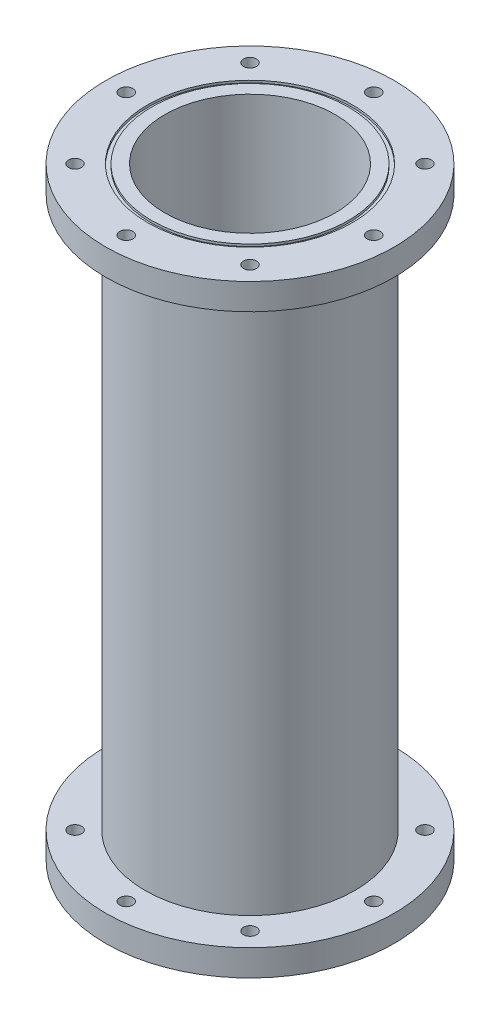
ISO-10303-21;
HEADER;
FILE_DESCRIPTION(('STEP AP214'),'2;1');
FILE_NAME('part.step','',(''),(''),'','','');
FILE_SCHEMA(('AUTOMOTIVE_DESIGN { 1 0 10303 214 1 1 1 1 }'));
ENDSEC;
DATA;
#1=APPLICATION_CONTEXT('core data for automotive mechanical design processes');
#2=APPLICATION_PROTOCOL_DEFINITION('international standard','automotive_design',2000,#1);
#3=PRODUCT_CONTEXT('',#1,'mechanical');
#4=PRODUCT('Part','Part','',(#3));
#5=PRODUCT_RELATED_PRODUCT_CATEGORY('part','',(#4));
#6=PRODUCT_DEFINITION_FORMATION('','',#4);
#7=PRODUCT_DEFINITION_CONTEXT('part definition',#1,'design');
#8=PRODUCT_DEFINITION('design','',#6,#7);
#9=PRODUCT_DEFINITION_SHAPE('','',#8);
#10=(LENGTH_UNIT() NAMED_UNIT(*) SI_UNIT(.MILLI.,.METRE.));
#11=(NAMED_UNIT(*) PLANE_ANGLE_UNIT() SI_UNIT($,.RADIAN.));
#12=(NAMED_UNIT(*) SI_UNIT($,.STERADIAN.) SOLID_ANGLE_UNIT());
#13=UNCERTAINTY_MEASURE_WITH_UNIT(LENGTH_MEASURE(1.E-05),#10,'distance_accuracy_value','');
#14=(GEOMETRIC_REPRESENTATION_CONTEXT(3) GLOBAL_UNCERTAINTY_ASSIGNED_CONTEXT((#13)) GLOBAL_UNIT_ASSIGNED_CONTEXT((#10,
#11,#12)) REPRESENTATION_CONTEXT('',''));
#15=CARTESIAN_POINT('',(0.,0.,0.));
#16=DIRECTION('',(0.,0.,1.));
#17=DIRECTION('',(1.,0.,0.));
#18=AXIS2_PLACEMENT_3D('',#15,#16,#17);
#19=CARTESIAN_POINT('',(0.,292.1,0.));
#20=DIRECTION('',(0.,1.,0.));
#21=DIRECTION('',(0.,0.,1.));
#22=AXIS2_PLACEMENT_3D('',#19,#20,#21);
#23=PLANE('',#22);
#24=CARTESIAN_POINT('',(0.,292.1,0.));
#25=DIRECTION('',(0.,1.,0.));
#26=DIRECTION('',(0.,0.,1.));
#27=AXIS2_PLACEMENT_3D('',#24,#25,#26);
#28=CIRCLE('',#27,41.275);
#29=CARTESIAN_POINT('',(0.,292.1,41.275));
#30=VERTEX_POINT('',#29);
#31=EDGE_CURVE('E45',#30,#30,#28,.T.);
#32=ORIENTED_EDGE('',*,*,#31,.F.);
#33=EDGE_LOOP('',(#32));
#34=FACE_BOUND('',#33,.T.);
#35=CARTESIAN_POINT('',(0.,292.1,0.));
#36=DIRECTION('',(0.,1.,0.));
#37=DIRECTION('',(0.,0.,1.));
#38=AXIS2_PLACEMENT_3D('',#35,#36,#37);
#39=CIRCLE('',#38,47.625);
#40=CARTESIAN_POINT('',(0.,292.1,47.625));
#41=VERTEX_POINT('',#40);
#42=EDGE_CURVE('E117',#41,#41,#39,.T.);
#43=ORIENTED_EDGE('',*,*,#42,.T.);
#44=EDGE_LOOP('',(#43));
#45=FACE_BOUND('',#44,.T.);
#46=ADVANCED_FACE('F32',(#34,#45),#23,.T.);
#47=CARTESIAN_POINT('',(0.,0.,0.));
#48=DIRECTION('',(0.,1.,0.));
#49=DIRECTION('',(0.,0.,1.));
#50=AXIS2_PLACEMENT_3D('',#47,#48,#49);
#51=PLANE('',#50);
#52=CARTESIAN_POINT('',(0.,0.,0.));
#53=DIRECTION('',(0.,1.,0.));
#54=DIRECTION('',(0.,0.,1.));
#55=AXIS2_PLACEMENT_3D('',#52,#53,#54);
#56=CIRCLE('',#55,41.275);
#57=CARTESIAN_POINT('',(0.,0.,41.275));
#58=VERTEX_POINT('',#57);
#59=EDGE_CURVE('E54',#58,#58,#56,.T.);
#60=ORIENTED_EDGE('',*,*,#59,.T.);
#61=EDGE_LOOP('',(#60));
#62=FACE_BOUND('',#61,.T.);
#63=CARTESIAN_POINT('',(0.,0.,0.));
#64=DIRECTION('',(0.,-1.,0.));
#65=DIRECTION('',(0.,0.,-1.));
#66=AXIS2_PLACEMENT_3D('',#63,#64,#65);
#67=CIRCLE('',#66,47.625);
#68=CARTESIAN_POINT('',(0.,0.,-47.625));
#69=VERTEX_POINT('',#68);
#70=EDGE_CURVE('E127',#69,#69,#67,.T.);
#71=ORIENTED_EDGE('',*,*,#70,.T.);
#72=EDGE_LOOP('',(#71));
#73=FACE_BOUND('',#72,.T.);
#74=ADVANCED_FACE('F165',(#62,#73),#51,.F.);
#75=CARTESIAN_POINT('',(0.,292.1,0.));
#76=DIRECTION('',(0.,-1.,0.));
#77=DIRECTION('',(0.,0.,-1.));
#78=AXIS2_PLACEMENT_3D('',#75,#76,#77);
#79=CYLINDRICAL_SURFACE('',#78,50.8);
#80=CARTESIAN_POINT('',(0.,12.7,0.));
#81=DIRECTION('',(0.,-1.,0.));
#82=DIRECTION('',(0.,0.,-1.));
#83=AXIS2_PLACEMENT_3D('',#80,#81,#82);
#84=CIRCLE('',#83,50.8);
#85=CARTESIAN_POINT('',(0.,12.7,-50.8));
#86=VERTEX_POINT('',#85);
#87=EDGE_CURVE('E40',#86,#86,#84,.T.);
#88=ORIENTED_EDGE('',*,*,#87,.F.);
#89=EDGE_LOOP('',(#88));
#90=FACE_BOUND('',#89,.T.);
#91=CARTESIAN_POINT('',(0.,279.4,0.));
#92=DIRECTION('',(0.,1.,0.));
#93=DIRECTION('',(0.,0.,1.));
#94=AXIS2_PLACEMENT_3D('',#91,#92,#93);
#95=CIRCLE('',#94,50.8);
#96=CARTESIAN_POINT('',(0.,279.4,50.8));
#97=VERTEX_POINT('',#96);
#98=EDGE_CURVE('E10',#97,#97,#95,.T.);
#99=ORIENTED_EDGE('',*,*,#98,.F.);
#100=EDGE_LOOP('',(#99));
#101=FACE_BOUND('',#100,.T.);
#102=ADVANCED_FACE('F34',(#90,#101),#79,.T.);
#103=CARTESIAN_POINT('',(-59.9186,292.1,0.));
#104=DIRECTION('',(0.,-1.,0.));
#105=DIRECTION('',(0.,0.,-1.));
#106=AXIS2_PLACEMENT_3D('',#103,#104,#105);
#107=CIRCLE('',#106,3.175);
#108=CARTESIAN_POINT('',(-59.9186,292.1,-3.175));
#109=VERTEX_POINT('',#108);
#110=EDGE_CURVE('E67',#109,#109,#107,.T.);
#111=ORIENTED_EDGE('',*,*,#110,.T.);
#112=EDGE_LOOP('',(#111));
#113=FACE_BOUND('',#112,.T.);
#114=CARTESIAN_POINT('',(-42.3688483792043,292.1,42.3688483792043));
#115=DIRECTION('',(0.,-1.,0.));
#116=DIRECTION('',(0.,0.,-1.));
#117=AXIS2_PLACEMENT_3D('',#114,#115,#116);
#118=CIRCLE('',#117,3.175);
#119=CARTESIAN_POINT('',(-42.3688483792043,292.1,39.1938483792043));
#120=VERTEX_POINT('',#119);
#121=EDGE_CURVE('E191',#120,#120,#118,.T.);
#122=ORIENTED_EDGE('',*,*,#121,.T.);
#123=EDGE_LOOP('',(#122));
#124=FACE_BOUND('',#123,.T.);
#125=CARTESIAN_POINT('',(0.,292.1,59.9186));
#126=DIRECTION('',(0.,-1.,0.));
#127=DIRECTION('',(0.,0.,-1.));
#128=AXIS2_PLACEMENT_3D('',#125,#126,#127);
#129=CIRCLE('',#128,3.175);
#130=CARTESIAN_POINT('',(0.,292.1,56.7436));
#131=VERTEX_POINT('',#130);
#132=EDGE_CURVE('E195',#131,#131,#129,.T.);
#133=ORIENTED_EDGE('',*,*,#132,.T.);
#134=EDGE_LOOP('',(#133));
#135=FACE_BOUND('',#134,.T.);
#136=CARTESIAN_POINT('',(42.3688483792043,292.1,42.3688483792043));
#137=DIRECTION('',(0.,-1.,0.));
#138=DIRECTION('',(0.,0.,-1.));
#139=AXIS2_PLACEMENT_3D('',#136,#137,#138);
#140=CIRCLE('',#139,3.175);
#141=CARTESIAN_POINT('',(42.3688483792043,292.1,39.1938483792043));
#142=VERTEX_POINT('',#141);
#143=EDGE_CURVE('E199',#142,#142,#140,.T.);
#144=ORIENTED_EDGE('',*,*,#143,.T.);
#145=EDGE_LOOP('',(#144));
#146=FACE_BOUND('',#145,.T.);
#147=CARTESIAN_POINT('',(59.9186,292.1,0.));
#148=DIRECTION('',(0.,-1.,0.));
#149=DIRECTION('',(0.,0.,-1.));
#150=AXIS2_PLACEMENT_3D('',#147,#148,#149);
#151=CIRCLE('',#150,3.17500000000001);
#152=CARTESIAN_POINT('',(59.9186,292.1,-3.175));
#153=VERTEX_POINT('',#152);
#154=EDGE_CURVE('E203',#153,#153,#151,.T.);
#155=ORIENTED_EDGE('',*,*,#154,.T.);
#156=EDGE_LOOP('',(#155));
#157=FACE_BOUND('',#156,.T.);
#158=CARTESIAN_POINT('',(42.3688483792043,292.1,-42.3688483792043));
#159=DIRECTION('',(0.,-1.,0.));
#160=DIRECTION('',(0.,0.,-1.));
#161=AXIS2_PLACEMENT_3D('',#158,#159,#160);
#162=CIRCLE('',#161,3.17500000000001);
#163=CARTESIAN_POINT('',(42.3688483792043,292.1,-45.5438483792043));
#164=VERTEX_POINT('',#163);
#165=EDGE_CURVE('E207',#164,#164,#162,.T.);
#166=ORIENTED_EDGE('',*,*,#165,.T.);
#167=EDGE_LOOP('',(#166));
#168=FACE_BOUND('',#167,.T.);
#169=CARTESIAN_POINT('',(0.,292.1,-59.9186));
#170=DIRECTION('',(0.,-1.,0.));
#171=DIRECTION('',(0.,0.,-1.));
#172=AXIS2_PLACEMENT_3D('',#169,#170,#171);
#173=CIRCLE('',#172,3.175);
#174=CARTESIAN_POINT('',(0.,292.1,-63.0936));
#175=VERTEX_POINT('',#174);
#176=EDGE_CURVE('E211',#175,#175,#173,.T.);
#177=ORIENTED_EDGE('',*,*,#176,.T.);
#178=EDGE_LOOP('',(#177));
#179=FACE_BOUND('',#178,.T.);
#180=CARTESIAN_POINT('',(-42.3688483792043,292.1,-42.3688483792043));
#181=DIRECTION('',(0.,-1.,0.));
#182=DIRECTION('',(0.,0.,-1.));
#183=AXIS2_PLACEMENT_3D('',#180,#181,#182);
#184=CIRCLE('',#183,3.17500000000001);
#185=CARTESIAN_POINT('',(-42.3688483792043,292.1,-45.5438483792043));
#186=VERTEX_POINT('',#185);
#187=EDGE_CURVE('E215',#186,#186,#184,.T.);
#188=ORIENTED_EDGE('',*,*,#187,.T.);
#189=EDGE_LOOP('',(#188));
#190=FACE_BOUND('',#189,.T.);
#191=CARTESIAN_POINT('',(0.,292.1,0.));
#192=DIRECTION('',(0.,1.,0.));
#193=DIRECTION('',(0.,0.,1.));
#194=AXIS2_PLACEMENT_3D('',#191,#192,#193);
#195=CIRCLE('',#194,49.53);
#196=CARTESIAN_POINT('',(0.,292.1,49.53));
#197=VERTEX_POINT('',#196);
#198=EDGE_CURVE('E121',#197,#197,#195,.T.);
#199=ORIENTED_EDGE('',*,*,#198,.F.);
#200=EDGE_LOOP('',(#199));
#201=FACE_BOUND('',#200,.T.);
#202=CARTESIAN_POINT('',(0.,292.1,0.));
#203=DIRECTION('',(0.,1.,0.));
#204=DIRECTION('',(0.,0.,1.));
#205=AXIS2_PLACEMENT_3D('',#202,#203,#204);
#206=CIRCLE('',#205,69.85);
#207=CARTESIAN_POINT('',(0.,292.1,69.85));
#208=VERTEX_POINT('',#207);
#209=EDGE_CURVE('E49',#208,#208,#206,.T.);
#210=ORIENTED_EDGE('',*,*,#209,.T.);
#211=EDGE_LOOP('',(#210));
#212=FACE_BOUND('',#211,.T.);
#213=ADVANCED_FACE('F146',(#113,#124,#135,#146,#157,#168,#179,#190,#201,#212),#23,.T.);
#214=CARTESIAN_POINT('',(-59.9186,0.,0.));
#215=DIRECTION('',(0.,1.,0.));
#216=DIRECTION('',(0.,0.,1.));
#217=AXIS2_PLACEMENT_3D('',#214,#215,#216);
#218=CIRCLE('',#217,3.175);
#219=CARTESIAN_POINT('',(-59.9186,0.,3.175));
#220=VERTEX_POINT('',#219);
#221=EDGE_CURVE('E114',#220,#220,#218,.T.);
#222=ORIENTED_EDGE('',*,*,#221,.T.);
#223=EDGE_LOOP('',(#222));
#224=FACE_BOUND('',#223,.T.);
#225=CARTESIAN_POINT('',(-42.3688483792043,0.,42.3688483792043));
#226=DIRECTION('',(0.,1.,0.));
#227=DIRECTION('',(0.,0.,1.));
#228=AXIS2_PLACEMENT_3D('',#225,#226,#227);
#229=CIRCLE('',#228,3.175);
#230=CARTESIAN_POINT('',(-42.3688483792043,0.,45.5438483792043));
#231=VERTEX_POINT('',#230);
#232=EDGE_CURVE('E99',#231,#231,#229,.T.);
#233=ORIENTED_EDGE('',*,*,#232,.T.);
#234=EDGE_LOOP('',(#233));
#235=FACE_BOUND('',#234,.T.);
#236=CARTESIAN_POINT('',(0.,0.,59.9186));
#237=DIRECTION('',(0.,1.,0.));
#238=DIRECTION('',(0.,0.,1.));
#239=AXIS2_PLACEMENT_3D('',#236,#237,#238);
#240=CIRCLE('',#239,3.175);
#241=CARTESIAN_POINT('',(0.,0.,63.0936));
#242=VERTEX_POINT('',#241);
#243=EDGE_CURVE('E95',#242,#242,#240,.T.);
#244=ORIENTED_EDGE('',*,*,#243,.T.);
#245=EDGE_LOOP('',(#244));
#246=FACE_BOUND('',#245,.T.);
#247=CARTESIAN_POINT('',(42.3688483792043,0.,42.3688483792043));
#248=DIRECTION('',(0.,1.,0.));
#249=DIRECTION('',(0.,0.,1.));
#250=AXIS2_PLACEMENT_3D('',#247,#248,#249);
#251=CIRCLE('',#250,3.175);
#252=CARTESIAN_POINT('',(42.3688483792043,0.,45.5438483792043));
#253=VERTEX_POINT('',#252);
#254=EDGE_CURVE('E91',#253,#253,#251,.T.);
#255=ORIENTED_EDGE('',*,*,#254,.T.);
#256=EDGE_LOOP('',(#255));
#257=FACE_BOUND('',#256,.T.);
#258=CARTESIAN_POINT('',(59.9186,0.,0.));
#259=DIRECTION('',(0.,1.,0.));
#260=DIRECTION('',(0.,0.,1.));
#261=AXIS2_PLACEMENT_3D('',#258,#259,#260);
#262=CIRCLE('',#261,3.17500000000001);
#263=CARTESIAN_POINT('',(59.9186,0.,3.17500000000001));
#264=VERTEX_POINT('',#263);
#265=EDGE_CURVE('E87',#264,#264,#262,.T.);
#266=ORIENTED_EDGE('',*,*,#265,.T.);
#267=EDGE_LOOP('',(#266));
#268=FACE_BOUND('',#267,.T.);
#269=CARTESIAN_POINT('',(42.3688483792043,0.,-42.3688483792043));
#270=DIRECTION('',(0.,1.,0.));
#271=DIRECTION('',(0.,0.,1.));
#272=AXIS2_PLACEMENT_3D('',#269,#270,#271);
#273=CIRCLE('',#272,3.17500000000001);
#274=CARTESIAN_POINT('',(42.3688483792043,0.,-39.1938483792043));
#275=VERTEX_POINT('',#274);
#276=EDGE_CURVE('E82',#275,#275,#273,.T.);
#277=ORIENTED_EDGE('',*,*,#276,.T.);
#278=EDGE_LOOP('',(#277));
#279=FACE_BOUND('',#278,.T.);
#280=CARTESIAN_POINT('',(0.,0.,-59.9186));
#281=DIRECTION('',(0.,1.,0.));
#282=DIRECTION('',(0.,0.,1.));
#283=AXIS2_PLACEMENT_3D('',#280,#281,#282);
#284=CIRCLE('',#283,3.175);
#285=CARTESIAN_POINT('',(0.,0.,-56.7436));
#286=VERTEX_POINT('',#285);
#287=EDGE_CURVE('E77',#286,#286,#284,.T.);
#288=ORIENTED_EDGE('',*,*,#287,.T.);
#289=EDGE_LOOP('',(#288));
#290=FACE_BOUND('',#289,.T.);
#291=CARTESIAN_POINT('',(-42.3688483792043,0.,-42.3688483792043));
#292=DIRECTION('',(0.,1.,0.));
#293=DIRECTION('',(0.,0.,1.));
#294=AXIS2_PLACEMENT_3D('',#291,#292,#293);
#295=CIRCLE('',#294,3.17500000000001);
#296=CARTESIAN_POINT('',(-42.3688483792043,0.,-39.1938483792043));
#297=VERTEX_POINT('',#296);
#298=EDGE_CURVE('E72',#297,#297,#295,.T.);
#299=ORIENTED_EDGE('',*,*,#298,.T.);
#300=EDGE_LOOP('',(#299));
#301=FACE_BOUND('',#300,.T.);
#302=CARTESIAN_POINT('',(0.,0.,0.));
#303=DIRECTION('',(0.,-1.,0.));
#304=DIRECTION('',(0.,0.,-1.));
#305=AXIS2_PLACEMENT_3D('',#302,#303,#304);
#306=CIRCLE('',#305,49.53);
#307=CARTESIAN_POINT('',(0.,0.,-49.53));
#308=VERTEX_POINT('',#307);
#309=EDGE_CURVE('E133',#308,#308,#306,.T.);
#310=ORIENTED_EDGE('',*,*,#309,.F.);
#311=EDGE_LOOP('',(#310));
#312=FACE_BOUND('',#311,.T.);
#313=CARTESIAN_POINT('',(0.,0.,0.));
#314=DIRECTION('',(0.,-1.,0.));
#315=DIRECTION('',(0.,0.,-1.));
#316=AXIS2_PLACEMENT_3D('',#313,#314,#315);
#317=CIRCLE('',#316,69.85);
#318=CARTESIAN_POINT('',(0.,0.,-69.85));
#319=VERTEX_POINT('',#318);
#320=EDGE_CURVE('E55',#319,#319,#317,.T.);
#321=ORIENTED_EDGE('',*,*,#320,.T.);
#322=EDGE_LOOP('',(#321));
#323=FACE_BOUND('',#322,.T.);
#324=ADVANCED_FACE('F172',(#224,#235,#246,#257,#268,#279,#290,#301,#312,#323),#51,.F.);
#325=CARTESIAN_POINT('',(0.,292.1,0.));
#326=DIRECTION('',(0.,-1.,0.));
#327=DIRECTION('',(0.,0.,-1.));
#328=AXIS2_PLACEMENT_3D('',#325,#326,#327);
#329=CYLINDRICAL_SURFACE('',#328,41.275);
#330=ORIENTED_EDGE('',*,*,#31,.T.);
#331=EDGE_LOOP('',(#330));
#332=FACE_BOUND('',#331,.T.);
#333=ORIENTED_EDGE('',*,*,#59,.F.);
#334=EDGE_LOOP('',(#333));
#335=FACE_BOUND('',#334,.T.);
#336=ADVANCED_FACE('F182',(#332,#335),#329,.F.);
#337=CARTESIAN_POINT('',(0.,12.7,0.));
#338=DIRECTION('',(0.,-1.,0.));
#339=DIRECTION('',(0.,0.,-1.));
#340=AXIS2_PLACEMENT_3D('',#337,#338,#339);
#341=PLANE('',#340);
#342=CARTESIAN_POINT('',(-59.9186,12.7,0.));
#343=DIRECTION('',(0.,-1.,0.));
#344=DIRECTION('',(0.,0.,-1.));
#345=AXIS2_PLACEMENT_3D('',#342,#343,#344);
#346=CIRCLE('',#345,3.175);
#347=CARTESIAN_POINT('',(-59.9186,12.7,-3.175));
#348=VERTEX_POINT('',#347);
#349=EDGE_CURVE('E111',#348,#348,#346,.T.);
#350=ORIENTED_EDGE('',*,*,#349,.T.);
#351=EDGE_LOOP('',(#350));
#352=FACE_BOUND('',#351,.T.);
#353=CARTESIAN_POINT('',(-42.3688483792043,12.7,42.3688483792043));
#354=DIRECTION('',(0.,-1.,0.));
#355=DIRECTION('',(0.,0.,-1.));
#356=AXIS2_PLACEMENT_3D('',#353,#354,#355);
#357=CIRCLE('',#356,3.175);
#358=CARTESIAN_POINT('',(-42.3688483792043,12.7,39.1938483792043));
#359=VERTEX_POINT('',#358);
#360=EDGE_CURVE('E94',#359,#359,#357,.T.);
#361=ORIENTED_EDGE('',*,*,#360,.T.);
#362=EDGE_LOOP('',(#361));
#363=FACE_BOUND('',#362,.T.);
#364=CARTESIAN_POINT('',(0.,12.7,59.9186));
#365=DIRECTION('',(0.,-1.,0.));
#366=DIRECTION('',(0.,0.,-1.));
#367=AXIS2_PLACEMENT_3D('',#364,#365,#366);
#368=CIRCLE('',#367,3.175);
#369=CARTESIAN_POINT('',(0.,12.7,56.7436));
#370=VERTEX_POINT('',#369);
#371=EDGE_CURVE('E90',#370,#370,#368,.T.);
#372=ORIENTED_EDGE('',*,*,#371,.T.);
#373=EDGE_LOOP('',(#372));
#374=FACE_BOUND('',#373,.T.);
#375=CARTESIAN_POINT('',(42.3688483792043,12.7,42.3688483792043));
#376=DIRECTION('',(0.,-1.,0.));
#377=DIRECTION('',(0.,0.,-1.));
#378=AXIS2_PLACEMENT_3D('',#375,#376,#377);
#379=CIRCLE('',#378,3.175);
#380=CARTESIAN_POINT('',(42.3688483792043,12.7,39.1938483792043));
#381=VERTEX_POINT('',#380);
#382=EDGE_CURVE('E86',#381,#381,#379,.T.);
#383=ORIENTED_EDGE('',*,*,#382,.T.);
#384=EDGE_LOOP('',(#383));
#385=FACE_BOUND('',#384,.T.);
#386=CARTESIAN_POINT('',(59.9186,12.7,0.));
#387=DIRECTION('',(0.,-1.,0.));
#388=DIRECTION('',(0.,0.,-1.));
#389=AXIS2_PLACEMENT_3D('',#386,#387,#388);
#390=CIRCLE('',#389,3.17500000000001);
#391=CARTESIAN_POINT('',(59.9186,12.7,-3.175));
#392=VERTEX_POINT('',#391);
#393=EDGE_CURVE('E81',#392,#392,#390,.T.);
#394=ORIENTED_EDGE('',*,*,#393,.T.);
#395=EDGE_LOOP('',(#394));
#396=FACE_BOUND('',#395,.T.);
#397=CARTESIAN_POINT('',(42.3688483792043,12.7,-42.3688483792043));
#398=DIRECTION('',(0.,-1.,0.));
#399=DIRECTION('',(0.,0.,-1.));
#400=AXIS2_PLACEMENT_3D('',#397,#398,#399);
#401=CIRCLE('',#400,3.17500000000001);
#402=CARTESIAN_POINT('',(42.3688483792043,12.7,-45.5438483792043));
#403=VERTEX_POINT('',#402);
#404=EDGE_CURVE('E76',#403,#403,#401,.T.);
#405=ORIENTED_EDGE('',*,*,#404,.T.);
#406=EDGE_LOOP('',(#405));
#407=FACE_BOUND('',#406,.T.);
#408=CARTESIAN_POINT('',(0.,12.7,-59.9186));
#409=DIRECTION('',(0.,-1.,0.));
#410=DIRECTION('',(0.,0.,-1.));
#411=AXIS2_PLACEMENT_3D('',#408,#409,#410);
#412=CIRCLE('',#411,3.175);
#413=CARTESIAN_POINT('',(0.,12.7,-63.0936));
#414=VERTEX_POINT('',#413);
#415=EDGE_CURVE('E71',#414,#414,#412,.T.);
#416=ORIENTED_EDGE('',*,*,#415,.T.);
#417=EDGE_LOOP('',(#416));
#418=FACE_BOUND('',#417,.T.);
#419=CARTESIAN_POINT('',(-42.3688483792043,12.7,-42.3688483792043));
#420=DIRECTION('',(0.,-1.,0.));
#421=DIRECTION('',(0.,0.,-1.));
#422=AXIS2_PLACEMENT_3D('',#419,#420,#421);
#423=CIRCLE('',#422,3.17500000000001);
#424=CARTESIAN_POINT('',(-42.3688483792043,12.7,-45.5438483792043));
#425=VERTEX_POINT('',#424);
#426=EDGE_CURVE('E66',#425,#425,#423,.T.);
#427=ORIENTED_EDGE('',*,*,#426,.T.);
#428=EDGE_LOOP('',(#427));
#429=FACE_BOUND('',#428,.T.);
#430=CARTESIAN_POINT('',(0.,12.7,0.));
#431=DIRECTION('',(0.,-1.,0.));
#432=DIRECTION('',(0.,0.,-1.));
#433=AXIS2_PLACEMENT_3D('',#430,#431,#432);
#434=CIRCLE('',#433,69.85);
#435=CARTESIAN_POINT('',(0.,12.7,-69.85));
#436=VERTEX_POINT('',#435);
#437=EDGE_CURVE('E51',#436,#436,#434,.T.);
#438=ORIENTED_EDGE('',*,*,#437,.F.);
#439=EDGE_LOOP('',(#438));
#440=FACE_BOUND('',#439,.T.);
#441=ORIENTED_EDGE('',*,*,#87,.T.);
#442=EDGE_LOOP('',(#441));
#443=FACE_BOUND('',#442,.T.);
#444=ADVANCED_FACE('F250',(#352,#363,#374,#385,#396,#407,#418,#429,#440,#443),#341,.F.);
#445=CARTESIAN_POINT('',(0.,12.7,0.));
#446=DIRECTION('',(0.,-1.,0.));
#447=DIRECTION('',(0.,0.,-1.));
#448=AXIS2_PLACEMENT_3D('',#445,#446,#447);
#449=CYLINDRICAL_SURFACE('',#448,69.85);
#450=ORIENTED_EDGE('',*,*,#437,.T.);
#451=EDGE_LOOP('',(#450));
#452=FACE_BOUND('',#451,.T.);
#453=ORIENTED_EDGE('',*,*,#320,.F.);
#454=EDGE_LOOP('',(#453));
#455=FACE_BOUND('',#454,.T.);
#456=ADVANCED_FACE('F160',(#452,#455),#449,.T.);
#457=CARTESIAN_POINT('',(0.,279.4,0.));
#458=DIRECTION('',(0.,1.,0.));
#459=DIRECTION('',(0.,0.,1.));
#460=AXIS2_PLACEMENT_3D('',#457,#458,#459);
#461=PLANE('',#460);
#462=CARTESIAN_POINT('',(-59.9186,279.4,0.));
#463=DIRECTION('',(0.,1.,0.));
#464=DIRECTION('',(0.,0.,1.));
#465=AXIS2_PLACEMENT_3D('',#462,#463,#464);
#466=CIRCLE('',#465,3.175);
#467=CARTESIAN_POINT('',(-59.9186,279.4,3.175));
#468=VERTEX_POINT('',#467);
#469=EDGE_CURVE('E36',#468,#468,#466,.T.);
#470=ORIENTED_EDGE('',*,*,#469,.T.);
#471=EDGE_LOOP('',(#470));
#472=FACE_BOUND('',#471,.T.);
#473=CARTESIAN_POINT('',(-42.3688483792043,279.4,42.3688483792043));
#474=DIRECTION('',(0.,1.,0.));
#475=DIRECTION('',(0.,0.,1.));
#476=AXIS2_PLACEMENT_3D('',#473,#474,#475);
#477=CIRCLE('',#476,3.175);
#478=CARTESIAN_POINT('',(-42.3688483792043,279.4,45.5438483792043));
#479=VERTEX_POINT('',#478);
#480=EDGE_CURVE('E92',#479,#479,#477,.T.);
#481=ORIENTED_EDGE('',*,*,#480,.T.);
#482=EDGE_LOOP('',(#481));
#483=FACE_BOUND('',#482,.T.);
#484=CARTESIAN_POINT('',(0.,279.4,59.9186));
#485=DIRECTION('',(0.,1.,0.));
#486=DIRECTION('',(0.,0.,1.));
#487=AXIS2_PLACEMENT_3D('',#484,#485,#486);
#488=CIRCLE('',#487,3.175);
#489=CARTESIAN_POINT('',(0.,279.4,63.0936));
#490=VERTEX_POINT('',#489);
#491=EDGE_CURVE('E88',#490,#490,#488,.T.);
#492=ORIENTED_EDGE('',*,*,#491,.T.);
#493=EDGE_LOOP('',(#492));
#494=FACE_BOUND('',#493,.T.);
#495=CARTESIAN_POINT('',(42.3688483792043,279.4,42.3688483792043));
#496=DIRECTION('',(0.,1.,0.));
#497=DIRECTION('',(0.,0.,1.));
#498=AXIS2_PLACEMENT_3D('',#495,#496,#497);
#499=CIRCLE('',#498,3.175);
#500=CARTESIAN_POINT('',(42.3688483792043,279.4,45.5438483792043));
#501=VERTEX_POINT('',#500);
#502=EDGE_CURVE('E83',#501,#501,#499,.T.);
#503=ORIENTED_EDGE('',*,*,#502,.T.);
#504=EDGE_LOOP('',(#503));
#505=FACE_BOUND('',#504,.T.);
#506=CARTESIAN_POINT('',(59.9186,279.4,0.));
#507=DIRECTION('',(0.,1.,0.));
#508=DIRECTION('',(0.,0.,1.));
#509=AXIS2_PLACEMENT_3D('',#506,#507,#508);
#510=CIRCLE('',#509,3.17500000000001);
#511=CARTESIAN_POINT('',(59.9186,279.4,3.17500000000001));
#512=VERTEX_POINT('',#511);
#513=EDGE_CURVE('E78',#512,#512,#510,.T.);
#514=ORIENTED_EDGE('',*,*,#513,.T.);
#515=EDGE_LOOP('',(#514));
#516=FACE_BOUND('',#515,.T.);
#517=CARTESIAN_POINT('',(42.3688483792043,279.4,-42.3688483792043));
#518=DIRECTION('',(0.,1.,0.));
#519=DIRECTION('',(0.,0.,1.));
#520=AXIS2_PLACEMENT_3D('',#517,#518,#519);
#521=CIRCLE('',#520,3.17500000000001);
#522=CARTESIAN_POINT('',(42.3688483792043,279.4,-39.1938483792043));
#523=VERTEX_POINT('',#522);
#524=EDGE_CURVE('E73',#523,#523,#521,.T.);
#525=ORIENTED_EDGE('',*,*,#524,.T.);
#526=EDGE_LOOP('',(#525));
#527=FACE_BOUND('',#526,.T.);
#528=CARTESIAN_POINT('',(0.,279.4,-59.9186));
#529=DIRECTION('',(0.,1.,0.));
#530=DIRECTION('',(0.,0.,1.));
#531=AXIS2_PLACEMENT_3D('',#528,#529,#530);
#532=CIRCLE('',#531,3.175);
#533=CARTESIAN_POINT('',(0.,279.4,-56.7436));
#534=VERTEX_POINT('',#533);
#535=EDGE_CURVE('E68',#534,#534,#532,.T.);
#536=ORIENTED_EDGE('',*,*,#535,.T.);
#537=EDGE_LOOP('',(#536));
#538=FACE_BOUND('',#537,.T.);
#539=CARTESIAN_POINT('',(-42.3688483792043,279.4,-42.3688483792043));
#540=DIRECTION('',(0.,1.,0.));
#541=DIRECTION('',(0.,0.,1.));
#542=AXIS2_PLACEMENT_3D('',#539,#540,#541);
#543=CIRCLE('',#542,3.17500000000001);
#544=CARTESIAN_POINT('',(-42.3688483792043,279.4,-39.1938483792043));
#545=VERTEX_POINT('',#544);
#546=EDGE_CURVE('E63',#545,#545,#543,.T.);
#547=ORIENTED_EDGE('',*,*,#546,.T.);
#548=EDGE_LOOP('',(#547));
#549=FACE_BOUND('',#548,.T.);
#550=CARTESIAN_POINT('',(0.,279.4,0.));
#551=DIRECTION('',(0.,1.,0.));
#552=DIRECTION('',(0.,0.,1.));
#553=AXIS2_PLACEMENT_3D('',#550,#551,#552);
#554=CIRCLE('',#553,69.85);
#555=CARTESIAN_POINT('',(0.,279.4,69.85));
#556=VERTEX_POINT('',#555);
#557=EDGE_CURVE('E57',#556,#556,#554,.T.);
#558=ORIENTED_EDGE('',*,*,#557,.F.);
#559=EDGE_LOOP('',(#558));
#560=FACE_BOUND('',#559,.T.);
#561=ORIENTED_EDGE('',*,*,#98,.T.);
#562=EDGE_LOOP('',(#561));
#563=FACE_BOUND('',#562,.T.);
#564=ADVANCED_FACE('F151',(#472,#483,#494,#505,#516,#527,#538,#549,#560,#563),#461,.F.);
#565=CARTESIAN_POINT('',(0.,279.4,0.));
#566=DIRECTION('',(0.,1.,0.));
#567=DIRECTION('',(0.,0.,1.));
#568=AXIS2_PLACEMENT_3D('',#565,#566,#567);
#569=CYLINDRICAL_SURFACE('',#568,69.85);
#570=ORIENTED_EDGE('',*,*,#557,.T.);
#571=EDGE_LOOP('',(#570));
#572=FACE_BOUND('',#571,.T.);
#573=ORIENTED_EDGE('',*,*,#209,.F.);
#574=EDGE_LOOP('',(#573));
#575=FACE_BOUND('',#574,.T.);
#576=ADVANCED_FACE('F148',(#572,#575),#569,.T.);
#577=CARTESIAN_POINT('',(0.,1.1176,0.));
#578=DIRECTION('',(0.,-1.,0.));
#579=DIRECTION('',(0.,0.,-1.));
#580=AXIS2_PLACEMENT_3D('',#577,#578,#579);
#581=CYLINDRICAL_SURFACE('',#580,49.53);
#582=CARTESIAN_POINT('',(0.,1.1176,0.));
#583=DIRECTION('',(0.,-1.,0.));
#584=DIRECTION('',(0.,0.,-1.));
#585=AXIS2_PLACEMENT_3D('',#582,#583,#584);
#586=CIRCLE('',#585,49.53);
#587=CARTESIAN_POINT('',(0.,1.1176,-49.53));
#588=VERTEX_POINT('',#587);
#589=EDGE_CURVE('E136',#588,#588,#586,.T.);
#590=ORIENTED_EDGE('',*,*,#589,.F.);
#591=EDGE_LOOP('',(#590));
#592=FACE_BOUND('',#591,.T.);
#593=ORIENTED_EDGE('',*,*,#309,.T.);
#594=EDGE_LOOP('',(#593));
#595=FACE_BOUND('',#594,.T.);
#596=ADVANCED_FACE('F150',(#592,#595),#581,.F.);
#597=CARTESIAN_POINT('',(0.,1.1176,0.));
#598=DIRECTION('',(0.,-1.,0.));
#599=DIRECTION('',(0.,0.,-1.));
#600=AXIS2_PLACEMENT_3D('',#597,#598,#599);
#601=PLANE('',#600);
#602=CARTESIAN_POINT('',(0.,1.1176,0.));
#603=DIRECTION('',(0.,-1.,0.));
#604=DIRECTION('',(0.,0.,-1.));
#605=AXIS2_PLACEMENT_3D('',#602,#603,#604);
#606=CIRCLE('',#605,47.625);
#607=CARTESIAN_POINT('',(0.,1.1176,-47.625));
#608=VERTEX_POINT('',#607);
#609=EDGE_CURVE('E130',#608,#608,#606,.T.);
#610=ORIENTED_EDGE('',*,*,#609,.F.);
#611=EDGE_LOOP('',(#610));
#612=FACE_BOUND('',#611,.T.);
#613=ORIENTED_EDGE('',*,*,#589,.T.);
#614=EDGE_LOOP('',(#613));
#615=FACE_BOUND('',#614,.T.);
#616=ADVANCED_FACE('F157',(#612,#615),#601,.T.);
#617=CARTESIAN_POINT('',(0.,1.1176,0.));
#618=DIRECTION('',(0.,-1.,0.));
#619=DIRECTION('',(0.,0.,-1.));
#620=AXIS2_PLACEMENT_3D('',#617,#618,#619);
#621=CYLINDRICAL_SURFACE('',#620,47.625);
#622=ORIENTED_EDGE('',*,*,#609,.T.);
#623=EDGE_LOOP('',(#622));
#624=FACE_BOUND('',#623,.T.);
#625=ORIENTED_EDGE('',*,*,#70,.F.);
#626=EDGE_LOOP('',(#625));
#627=FACE_BOUND('',#626,.T.);
#628=ADVANCED_FACE('F221',(#624,#627),#621,.T.);
#629=CARTESIAN_POINT('',(0.,290.9824,0.));
#630=DIRECTION('',(0.,1.,0.));
#631=DIRECTION('',(0.,0.,1.));
#632=AXIS2_PLACEMENT_3D('',#629,#630,#631);
#633=CYLINDRICAL_SURFACE('',#632,49.53);
#634=CARTESIAN_POINT('',(0.,290.9824,0.));
#635=DIRECTION('',(0.,1.,0.));
#636=DIRECTION('',(0.,0.,1.));
#637=AXIS2_PLACEMENT_3D('',#634,#635,#636);
#638=CIRCLE('',#637,49.53);
#639=CARTESIAN_POINT('',(0.,290.9824,49.53));
#640=VERTEX_POINT('',#639);
#641=EDGE_CURVE('E124',#640,#640,#638,.T.);
#642=ORIENTED_EDGE('',*,*,#641,.F.);
#643=EDGE_LOOP('',(#642));
#644=FACE_BOUND('',#643,.T.);
#645=ORIENTED_EDGE('',*,*,#198,.T.);
#646=EDGE_LOOP('',(#645));
#647=FACE_BOUND('',#646,.T.);
#648=ADVANCED_FACE('F218',(#644,#647),#633,.F.);
#649=CARTESIAN_POINT('',(0.,290.9824,0.));
#650=DIRECTION('',(0.,1.,0.));
#651=DIRECTION('',(0.,0.,1.));
#652=AXIS2_PLACEMENT_3D('',#649,#650,#651);
#653=PLANE('',#652);
#654=CARTESIAN_POINT('',(0.,290.9824,0.));
#655=DIRECTION('',(0.,1.,0.));
#656=DIRECTION('',(0.,0.,1.));
#657=AXIS2_PLACEMENT_3D('',#654,#655,#656);
#658=CIRCLE('',#657,47.625);
#659=CARTESIAN_POINT('',(0.,290.9824,47.625));
#660=VERTEX_POINT('',#659);
#661=EDGE_CURVE('E118',#660,#660,#658,.T.);
#662=ORIENTED_EDGE('',*,*,#661,.F.);
#663=EDGE_LOOP('',(#662));
#664=FACE_BOUND('',#663,.T.);
#665=ORIENTED_EDGE('',*,*,#641,.T.);
#666=EDGE_LOOP('',(#665));
#667=FACE_BOUND('',#666,.T.);
#668=ADVANCED_FACE('F220',(#664,#667),#653,.T.);
#669=CARTESIAN_POINT('',(0.,290.9824,0.));
#670=DIRECTION('',(0.,1.,0.));
#671=DIRECTION('',(0.,0.,1.));
#672=AXIS2_PLACEMENT_3D('',#669,#670,#671);
#673=CYLINDRICAL_SURFACE('',#672,47.625);
#674=ORIENTED_EDGE('',*,*,#661,.T.);
#675=EDGE_LOOP('',(#674));
#676=FACE_BOUND('',#675,.T.);
#677=ORIENTED_EDGE('',*,*,#42,.F.);
#678=EDGE_LOOP('',(#677));
#679=FACE_BOUND('',#678,.T.);
#680=ADVANCED_FACE('F228',(#676,#679),#673,.T.);
#681=CARTESIAN_POINT('',(-42.3688483792043,292.1,-42.3688483792043));
#682=DIRECTION('',(0.,-1.,0.));
#683=DIRECTION('',(0.,0.,-1.));
#684=AXIS2_PLACEMENT_3D('',#681,#682,#683);
#685=CYLINDRICAL_SURFACE('',#684,3.17500000000001);
#686=ORIENTED_EDGE('',*,*,#187,.F.);
#687=EDGE_LOOP('',(#686));
#688=FACE_BOUND('',#687,.T.);
#689=ORIENTED_EDGE('',*,*,#546,.F.);
#690=EDGE_LOOP('',(#689));
#691=FACE_BOUND('',#690,.T.);
#692=ADVANCED_FACE('F289',(#688,#691),#685,.F.);
#693=CARTESIAN_POINT('',(0.,292.1,-59.9186));
#694=DIRECTION('',(0.,-1.,0.));
#695=DIRECTION('',(0.,0.,-1.));
#696=AXIS2_PLACEMENT_3D('',#693,#694,#695);
#697=CYLINDRICAL_SURFACE('',#696,3.175);
#698=ORIENTED_EDGE('',*,*,#176,.F.);
#699=EDGE_LOOP('',(#698));
#700=FACE_BOUND('',#699,.T.);
#701=ORIENTED_EDGE('',*,*,#535,.F.);
#702=EDGE_LOOP('',(#701));
#703=FACE_BOUND('',#702,.T.);
#704=ADVANCED_FACE('F294',(#700,#703),#697,.F.);
#705=CARTESIAN_POINT('',(42.3688483792043,292.1,-42.3688483792043));
#706=DIRECTION('',(0.,-1.,0.));
#707=DIRECTION('',(0.,0.,-1.));
#708=AXIS2_PLACEMENT_3D('',#705,#706,#707);
#709=CYLINDRICAL_SURFACE('',#708,3.17500000000001);
#710=ORIENTED_EDGE('',*,*,#165,.F.);
#711=EDGE_LOOP('',(#710));
#712=FACE_BOUND('',#711,.T.);
#713=ORIENTED_EDGE('',*,*,#524,.F.);
#714=EDGE_LOOP('',(#713));
#715=FACE_BOUND('',#714,.T.);
#716=ADVANCED_FACE('F307',(#712,#715),#709,.F.);
#717=CARTESIAN_POINT('',(59.9186,292.1,0.));
#718=DIRECTION('',(0.,-1.,0.));
#719=DIRECTION('',(0.,0.,-1.));
#720=AXIS2_PLACEMENT_3D('',#717,#718,#719);
#721=CYLINDRICAL_SURFACE('',#720,3.17500000000001);
#722=ORIENTED_EDGE('',*,*,#154,.F.);
#723=EDGE_LOOP('',(#722));
#724=FACE_BOUND('',#723,.T.);
#725=ORIENTED_EDGE('',*,*,#513,.F.);
#726=EDGE_LOOP('',(#725));
#727=FACE_BOUND('',#726,.T.);
#728=ADVANCED_FACE('F318',(#724,#727),#721,.F.);
#729=CARTESIAN_POINT('',(42.3688483792043,292.1,42.3688483792043));
#730=DIRECTION('',(0.,-1.,0.));
#731=DIRECTION('',(0.,0.,-1.));
#732=AXIS2_PLACEMENT_3D('',#729,#730,#731);
#733=CYLINDRICAL_SURFACE('',#732,3.175);
#734=ORIENTED_EDGE('',*,*,#143,.F.);
#735=EDGE_LOOP('',(#734));
#736=FACE_BOUND('',#735,.T.);
#737=ORIENTED_EDGE('',*,*,#502,.F.);
#738=EDGE_LOOP('',(#737));
#739=FACE_BOUND('',#738,.T.);
#740=ADVANCED_FACE('F329',(#736,#739),#733,.F.);
#741=CARTESIAN_POINT('',(0.,292.1,59.9186));
#742=DIRECTION('',(0.,-1.,0.));
#743=DIRECTION('',(0.,0.,-1.));
#744=AXIS2_PLACEMENT_3D('',#741,#742,#743);
#745=CYLINDRICAL_SURFACE('',#744,3.175);
#746=ORIENTED_EDGE('',*,*,#132,.F.);
#747=EDGE_LOOP('',(#746));
#748=FACE_BOUND('',#747,.T.);
#749=ORIENTED_EDGE('',*,*,#491,.F.);
#750=EDGE_LOOP('',(#749));
#751=FACE_BOUND('',#750,.T.);
#752=ADVANCED_FACE('F340',(#748,#751),#745,.F.);
#753=CARTESIAN_POINT('',(-42.3688483792043,292.1,42.3688483792043));
#754=DIRECTION('',(0.,-1.,0.));
#755=DIRECTION('',(0.,0.,-1.));
#756=AXIS2_PLACEMENT_3D('',#753,#754,#755);
#757=CYLINDRICAL_SURFACE('',#756,3.175);
#758=ORIENTED_EDGE('',*,*,#121,.F.);
#759=EDGE_LOOP('',(#758));
#760=FACE_BOUND('',#759,.T.);
#761=ORIENTED_EDGE('',*,*,#480,.F.);
#762=EDGE_LOOP('',(#761));
#763=FACE_BOUND('',#762,.T.);
#764=ADVANCED_FACE('F351',(#760,#763),#757,.F.);
#765=CARTESIAN_POINT('',(-59.9186,292.1,0.));
#766=DIRECTION('',(0.,-1.,0.));
#767=DIRECTION('',(0.,0.,-1.));
#768=AXIS2_PLACEMENT_3D('',#765,#766,#767);
#769=CYLINDRICAL_SURFACE('',#768,3.175);
#770=ORIENTED_EDGE('',*,*,#110,.F.);
#771=EDGE_LOOP('',(#770));
#772=FACE_BOUND('',#771,.T.);
#773=ORIENTED_EDGE('',*,*,#469,.F.);
#774=EDGE_LOOP('',(#773));
#775=FACE_BOUND('',#774,.T.);
#776=ADVANCED_FACE('F362',(#772,#775),#769,.F.);
#777=ORIENTED_EDGE('',*,*,#426,.F.);
#778=EDGE_LOOP('',(#777));
#779=FACE_BOUND('',#778,.T.);
#780=ORIENTED_EDGE('',*,*,#298,.F.);
#781=EDGE_LOOP('',(#780));
#782=FACE_BOUND('',#781,.T.);
#783=ADVANCED_FACE('F297',(#779,#782),#685,.F.);
#784=ORIENTED_EDGE('',*,*,#415,.F.);
#785=EDGE_LOOP('',(#784));
#786=FACE_BOUND('',#785,.T.);
#787=ORIENTED_EDGE('',*,*,#287,.F.);
#788=EDGE_LOOP('',(#787));
#789=FACE_BOUND('',#788,.T.);
#790=ADVANCED_FACE('F310',(#786,#789),#697,.F.);
#791=ORIENTED_EDGE('',*,*,#404,.F.);
#792=EDGE_LOOP('',(#791));
#793=FACE_BOUND('',#792,.T.);
#794=ORIENTED_EDGE('',*,*,#276,.F.);
#795=EDGE_LOOP('',(#794));
#796=FACE_BOUND('',#795,.T.);
#797=ADVANCED_FACE('F321',(#793,#796),#709,.F.);
#798=ORIENTED_EDGE('',*,*,#393,.F.);
#799=EDGE_LOOP('',(#798));
#800=FACE_BOUND('',#799,.T.);
#801=ORIENTED_EDGE('',*,*,#265,.F.);
#802=EDGE_LOOP('',(#801));
#803=FACE_BOUND('',#802,.T.);
#804=ADVANCED_FACE('F332',(#800,#803),#721,.F.);
#805=ORIENTED_EDGE('',*,*,#382,.F.);
#806=EDGE_LOOP('',(#805));
#807=FACE_BOUND('',#806,.T.);
#808=ORIENTED_EDGE('',*,*,#254,.F.);
#809=EDGE_LOOP('',(#808));
#810=FACE_BOUND('',#809,.T.);
#811=ADVANCED_FACE('F343',(#807,#810),#733,.F.);
#812=ORIENTED_EDGE('',*,*,#371,.F.);
#813=EDGE_LOOP('',(#812));
#814=FACE_BOUND('',#813,.T.);
#815=ORIENTED_EDGE('',*,*,#243,.F.);
#816=EDGE_LOOP('',(#815));
#817=FACE_BOUND('',#816,.T.);
#818=ADVANCED_FACE('F354',(#814,#817),#745,.F.);
#819=ORIENTED_EDGE('',*,*,#360,.F.);
#820=EDGE_LOOP('',(#819));
#821=FACE_BOUND('',#820,.T.);
#822=ORIENTED_EDGE('',*,*,#232,.F.);
#823=EDGE_LOOP('',(#822));
#824=FACE_BOUND('',#823,.T.);
#825=ADVANCED_FACE('F365',(#821,#824),#757,.F.);
#826=ORIENTED_EDGE('',*,*,#349,.F.);
#827=EDGE_LOOP('',(#826));
#828=FACE_BOUND('',#827,.T.);
#829=ORIENTED_EDGE('',*,*,#221,.F.);
#830=EDGE_LOOP('',(#829));
#831=FACE_BOUND('',#830,.T.);
#832=ADVANCED_FACE('F375',(#828,#831),#769,.F.);
#833=CLOSED_SHELL('',(#46,#74,#102,#213,#324,#336,#444,#456,#564,#576,#596,#616,#628,#648,#668,
#680,#692,#704,#716,#728,#740,#752,#764,#776,#783,#790,#797,#804,#811,#818,#825,#832));
#834=MANIFOLD_SOLID_BREP('B2',#833);
#835=ADVANCED_BREP_SHAPE_REPRESENTATION('',(#18,#834),#14);
#836=SHAPE_DEFINITION_REPRESENTATION(#9,#835);
ENDSEC;
END-ISO-10303-21;
